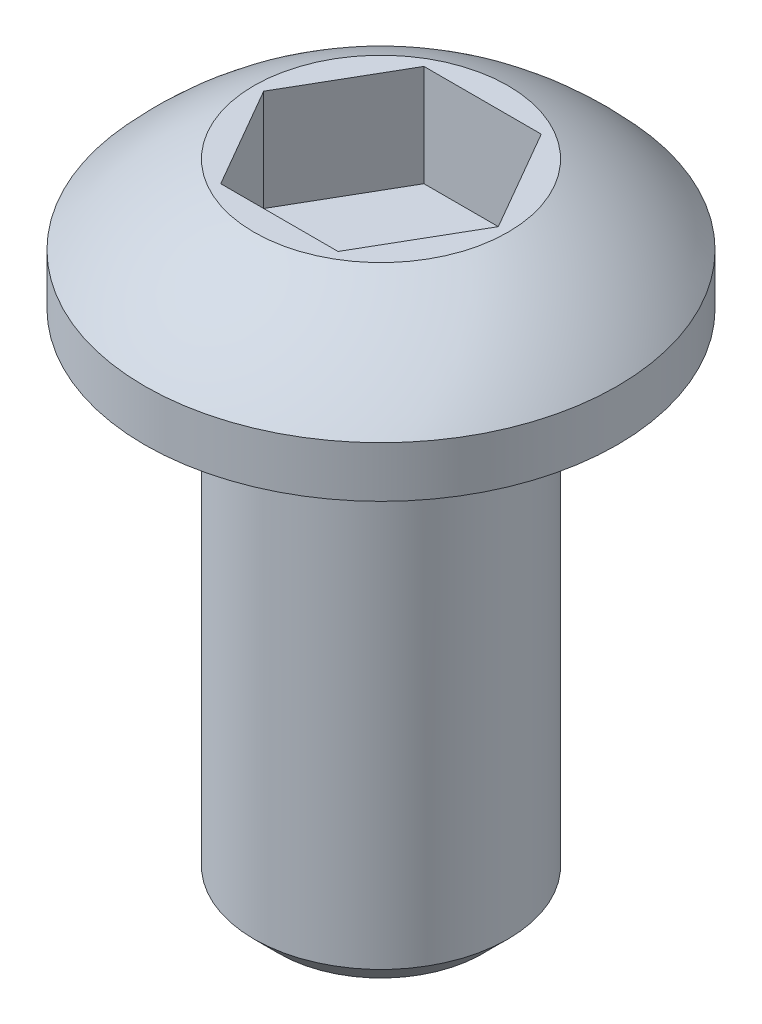
ISO-10303-21;
HEADER;
FILE_DESCRIPTION(('STEP AP214'),'2;1');
FILE_NAME('part.step','',(''),(''),'','','');
FILE_SCHEMA(('AUTOMOTIVE_DESIGN { 1 0 10303 214 1 1 1 1 }'));
ENDSEC;
DATA;
#1=APPLICATION_CONTEXT('core data for automotive mechanical design processes');
#2=APPLICATION_PROTOCOL_DEFINITION('international standard','automotive_design',2000,#1);
#3=PRODUCT_CONTEXT('',#1,'mechanical');
#4=PRODUCT('Part','Part','',(#3));
#5=PRODUCT_RELATED_PRODUCT_CATEGORY('part','',(#4));
#6=PRODUCT_DEFINITION_FORMATION('','',#4);
#7=PRODUCT_DEFINITION_CONTEXT('part definition',#1,'design');
#8=PRODUCT_DEFINITION('design','',#6,#7);
#9=PRODUCT_DEFINITION_SHAPE('','',#8);
#10=(LENGTH_UNIT() NAMED_UNIT(*) SI_UNIT(.MILLI.,.METRE.));
#11=(NAMED_UNIT(*) PLANE_ANGLE_UNIT() SI_UNIT($,.RADIAN.));
#12=(NAMED_UNIT(*) SI_UNIT($,.STERADIAN.) SOLID_ANGLE_UNIT());
#13=UNCERTAINTY_MEASURE_WITH_UNIT(LENGTH_MEASURE(1.E-05),#10,'distance_accuracy_value','');
#14=(GEOMETRIC_REPRESENTATION_CONTEXT(3) GLOBAL_UNCERTAINTY_ASSIGNED_CONTEXT((#13)) GLOBAL_UNIT_ASSIGNED_CONTEXT((#10,
#11,#12)) REPRESENTATION_CONTEXT('',''));
#15=CARTESIAN_POINT('',(0.,0.,0.));
#16=DIRECTION('',(0.,0.,1.));
#17=DIRECTION('',(1.,0.,0.));
#18=AXIS2_PLACEMENT_3D('',#15,#16,#17);
#19=CARTESIAN_POINT('',(2.3094010767585,10.55,0.));
#20=DIRECTION('',(0.,1.,0.));
#21=DIRECTION('',(0.,0.,1.));
#22=AXIS2_PLACEMENT_3D('',#19,#20,#21);
#23=PLANE('',#22);
#24=DIRECTION('',(-1.,0.,0.));
#25=VECTOR('',#24,1.);
#26=CARTESIAN_POINT('',(1.15470053837925,10.55,-2.));
#27=LINE('',#26,#25);
#28=CARTESIAN_POINT('',(1.15470053837925,10.55,-2.));
#29=VERTEX_POINT('',#28);
#30=CARTESIAN_POINT('',(-1.15470053837925,10.55,-2.));
#31=VERTEX_POINT('',#30);
#32=EDGE_CURVE('E72',#29,#31,#27,.T.);
#33=ORIENTED_EDGE('',*,*,#32,.T.);
#34=DIRECTION('',(-0.5,0.,0.866025403784439));
#35=VECTOR('',#34,1.);
#36=CARTESIAN_POINT('',(-1.15470053837925,10.55,-2.));
#37=LINE('',#36,#35);
#38=CARTESIAN_POINT('',(-2.3094010767585,10.55,0.));
#39=VERTEX_POINT('',#38);
#40=EDGE_CURVE('E127',#31,#39,#37,.T.);
#41=ORIENTED_EDGE('',*,*,#40,.T.);
#42=DIRECTION('',(0.5,0.,0.866025403784438));
#43=VECTOR('',#42,1.);
#44=CARTESIAN_POINT('',(-2.3094010767585,10.55,0.));
#45=LINE('',#44,#43);
#46=CARTESIAN_POINT('',(-1.15470053837925,10.55,2.));
#47=VERTEX_POINT('',#46);
#48=EDGE_CURVE('E132',#39,#47,#45,.T.);
#49=ORIENTED_EDGE('',*,*,#48,.T.);
#50=DIRECTION('',(1.,0.,0.));
#51=VECTOR('',#50,1.);
#52=CARTESIAN_POINT('',(-1.15470053837925,10.55,2.));
#53=LINE('',#52,#51);
#54=CARTESIAN_POINT('',(1.15470053837925,10.55,2.));
#55=VERTEX_POINT('',#54);
#56=EDGE_CURVE('E136',#47,#55,#53,.T.);
#57=ORIENTED_EDGE('',*,*,#56,.T.);
#58=DIRECTION('',(0.5,0.,-0.866025403784439));
#59=VECTOR('',#58,1.);
#60=CARTESIAN_POINT('',(1.15470053837925,10.55,2.));
#61=LINE('',#60,#59);
#62=CARTESIAN_POINT('',(2.3094010767585,10.55,0.));
#63=VERTEX_POINT('',#62);
#64=EDGE_CURVE('E68',#55,#63,#61,.T.);
#65=ORIENTED_EDGE('',*,*,#64,.T.);
#66=DIRECTION('',(-0.5,0.,-0.866025403784438));
#67=VECTOR('',#66,1.);
#68=CARTESIAN_POINT('',(2.3094010767585,10.55,0.));
#69=LINE('',#68,#67);
#70=EDGE_CURVE('E70',#63,#29,#69,.T.);
#71=ORIENTED_EDGE('',*,*,#70,.T.);
#72=EDGE_LOOP('',(#33,#41,#49,#57,#65,#71));
#73=FACE_BOUND('',#72,.T.);
#74=ADVANCED_FACE('F16',(#73),#23,.T.);
#75=CARTESIAN_POINT('',(1.15470053837925,10.55,-2.));
#76=DIRECTION('',(0.,0.,-1.));
#77=DIRECTION('',(-1.,0.,0.));
#78=AXIS2_PLACEMENT_3D('',#75,#76,#77);
#79=PLANE('',#78);
#80=ORIENTED_EDGE('',*,*,#32,.F.);
#81=DIRECTION('',(0.,1.,0.));
#82=VECTOR('',#81,1.);
#83=CARTESIAN_POINT('',(1.15470053837925,10.55,-2.));
#84=LINE('',#83,#82);
#85=CARTESIAN_POINT('',(1.15470053837925,12.55,-2.));
#86=VERTEX_POINT('',#85);
#87=EDGE_CURVE('E77',#29,#86,#84,.T.);
#88=ORIENTED_EDGE('',*,*,#87,.T.);
#89=DIRECTION('',(1.,0.,0.));
#90=VECTOR('',#89,1.);
#91=CARTESIAN_POINT('',(0.,12.55,-2.));
#92=LINE('',#91,#90);
#93=CARTESIAN_POINT('',(-1.15470053837925,12.55,-2.));
#94=VERTEX_POINT('',#93);
#95=EDGE_CURVE('E124',#94,#86,#92,.T.);
#96=ORIENTED_EDGE('',*,*,#95,.F.);
#97=DIRECTION('',(0.,1.,0.));
#98=VECTOR('',#97,1.);
#99=CARTESIAN_POINT('',(-1.15470053837925,10.55,-2.));
#100=LINE('',#99,#98);
#101=EDGE_CURVE('E83',#94,#31,#100,.F.);
#102=ORIENTED_EDGE('',*,*,#101,.T.);
#103=EDGE_LOOP('',(#80,#88,#96,#102));
#104=FACE_BOUND('',#103,.T.);
#105=ADVANCED_FACE('F80',(#104),#79,.F.);
#106=CARTESIAN_POINT('',(2.3094010767585,10.55,0.));
#107=DIRECTION('',(0.866025403784438,0.,-0.5));
#108=DIRECTION('',(-0.5,0.,-0.866025403784438));
#109=AXIS2_PLACEMENT_3D('',#106,#107,#108);
#110=PLANE('',#109);
#111=ORIENTED_EDGE('',*,*,#70,.F.);
#112=DIRECTION('',(0.,1.,0.));
#113=VECTOR('',#112,1.);
#114=CARTESIAN_POINT('',(2.3094010767585,10.55,0.));
#115=LINE('',#114,#113);
#116=CARTESIAN_POINT('',(2.3094010767585,12.55,0.));
#117=VERTEX_POINT('',#116);
#118=EDGE_CURVE('E91',#63,#117,#115,.T.);
#119=ORIENTED_EDGE('',*,*,#118,.T.);
#120=DIRECTION('',(0.5,0.,0.866025403784438));
#121=VECTOR('',#120,1.);
#122=CARTESIAN_POINT('',(1.15470053837925,12.55,-2.));
#123=LINE('',#122,#121);
#124=EDGE_CURVE('E88',#86,#117,#123,.T.);
#125=ORIENTED_EDGE('',*,*,#124,.F.);
#126=ORIENTED_EDGE('',*,*,#87,.F.);
#127=EDGE_LOOP('',(#111,#119,#125,#126));
#128=FACE_BOUND('',#127,.T.);
#129=ADVANCED_FACE('F86',(#128),#110,.F.);
#130=CARTESIAN_POINT('',(1.15470053837925,10.55,2.));
#131=DIRECTION('',(0.866025403784439,0.,0.5));
#132=DIRECTION('',(0.5,0.,-0.866025403784439));
#133=AXIS2_PLACEMENT_3D('',#130,#131,#132);
#134=PLANE('',#133);
#135=ORIENTED_EDGE('',*,*,#64,.F.);
#136=DIRECTION('',(0.,1.,0.));
#137=VECTOR('',#136,1.);
#138=CARTESIAN_POINT('',(1.15470053837925,10.55,2.));
#139=LINE('',#138,#137);
#140=CARTESIAN_POINT('',(1.15470053837925,12.55,2.));
#141=VERTEX_POINT('',#140);
#142=EDGE_CURVE('E134',#55,#141,#139,.T.);
#143=ORIENTED_EDGE('',*,*,#142,.T.);
#144=DIRECTION('',(-0.5,0.,0.866025403784438));
#145=VECTOR('',#144,1.);
#146=CARTESIAN_POINT('',(2.3094010767585,12.55,0.));
#147=LINE('',#146,#145);
#148=EDGE_CURVE('E120',#117,#141,#147,.T.);
#149=ORIENTED_EDGE('',*,*,#148,.F.);
#150=ORIENTED_EDGE('',*,*,#118,.F.);
#151=EDGE_LOOP('',(#135,#143,#149,#150));
#152=FACE_BOUND('',#151,.T.);
#153=ADVANCED_FACE('F139',(#152),#134,.F.);
#154=CARTESIAN_POINT('',(-1.15470053837925,10.55,2.));
#155=DIRECTION('',(0.,0.,1.));
#156=DIRECTION('',(1.,0.,0.));
#157=AXIS2_PLACEMENT_3D('',#154,#155,#156);
#158=PLANE('',#157);
#159=ORIENTED_EDGE('',*,*,#56,.F.);
#160=DIRECTION('',(0.,1.,0.));
#161=VECTOR('',#160,1.);
#162=CARTESIAN_POINT('',(-1.15470053837925,10.55,2.));
#163=LINE('',#162,#161);
#164=CARTESIAN_POINT('',(-1.15470053837925,12.55,2.));
#165=VERTEX_POINT('',#164);
#166=EDGE_CURVE('E130',#47,#165,#163,.T.);
#167=ORIENTED_EDGE('',*,*,#166,.T.);
#168=DIRECTION('',(1.,0.,0.));
#169=VECTOR('',#168,1.);
#170=CARTESIAN_POINT('',(0.,12.55,2.));
#171=LINE('',#170,#169);
#172=EDGE_CURVE('E115',#141,#165,#171,.F.);
#173=ORIENTED_EDGE('',*,*,#172,.F.);
#174=ORIENTED_EDGE('',*,*,#142,.F.);
#175=EDGE_LOOP('',(#159,#167,#173,#174));
#176=FACE_BOUND('',#175,.T.);
#177=ADVANCED_FACE('F150',(#176),#158,.F.);
#178=CARTESIAN_POINT('',(-2.3094010767585,10.55,0.));
#179=DIRECTION('',(-0.866025403784438,0.,0.5));
#180=DIRECTION('',(0.5,0.,0.866025403784438));
#181=AXIS2_PLACEMENT_3D('',#178,#179,#180);
#182=PLANE('',#181);
#183=ORIENTED_EDGE('',*,*,#48,.F.);
#184=DIRECTION('',(0.,1.,0.));
#185=VECTOR('',#184,1.);
#186=CARTESIAN_POINT('',(-2.3094010767585,10.55,0.));
#187=LINE('',#186,#185);
#188=CARTESIAN_POINT('',(-2.3094010767585,12.55,0.));
#189=VERTEX_POINT('',#188);
#190=EDGE_CURVE('E35',#39,#189,#187,.T.);
#191=ORIENTED_EDGE('',*,*,#190,.T.);
#192=DIRECTION('',(-0.5,0.,-0.866025403784438));
#193=VECTOR('',#192,1.);
#194=CARTESIAN_POINT('',(-1.15470053837925,12.55,2.));
#195=LINE('',#194,#193);
#196=EDGE_CURVE('E111',#165,#189,#195,.T.);
#197=ORIENTED_EDGE('',*,*,#196,.F.);
#198=ORIENTED_EDGE('',*,*,#166,.F.);
#199=EDGE_LOOP('',(#183,#191,#197,#198));
#200=FACE_BOUND('',#199,.T.);
#201=ADVANCED_FACE('F148',(#200),#182,.F.);
#202=CARTESIAN_POINT('',(-1.15470053837925,10.55,-2.));
#203=DIRECTION('',(-0.866025403784439,0.,-0.5));
#204=DIRECTION('',(-0.5,0.,0.866025403784439));
#205=AXIS2_PLACEMENT_3D('',#202,#203,#204);
#206=PLANE('',#205);
#207=ORIENTED_EDGE('',*,*,#40,.F.);
#208=ORIENTED_EDGE('',*,*,#101,.F.);
#209=DIRECTION('',(0.5,0.,-0.866025403784439));
#210=VECTOR('',#209,1.);
#211=CARTESIAN_POINT('',(-2.3094010767585,12.55,0.));
#212=LINE('',#211,#210);
#213=EDGE_CURVE('E107',#189,#94,#212,.T.);
#214=ORIENTED_EDGE('',*,*,#213,.F.);
#215=ORIENTED_EDGE('',*,*,#190,.F.);
#216=EDGE_LOOP('',(#207,#208,#214,#215));
#217=FACE_BOUND('',#216,.T.);
#218=ADVANCED_FACE('F145',(#217),#206,.F.);
#219=CARTESIAN_POINT('',(0.,12.55,0.));
#220=DIRECTION('',(0.,1.,0.));
#221=DIRECTION('',(0.,0.,1.));
#222=AXIS2_PLACEMENT_3D('',#219,#220,#221);
#223=PLANE('',#222);
#224=ORIENTED_EDGE('',*,*,#196,.T.);
#225=ORIENTED_EDGE('',*,*,#213,.T.);
#226=ORIENTED_EDGE('',*,*,#95,.T.);
#227=ORIENTED_EDGE('',*,*,#124,.T.);
#228=ORIENTED_EDGE('',*,*,#148,.T.);
#229=ORIENTED_EDGE('',*,*,#172,.T.);
#230=EDGE_LOOP('',(#224,#225,#226,#227,#228,#229));
#231=FACE_BOUND('',#230,.T.);
#232=CARTESIAN_POINT('',(0.,12.55,0.));
#233=DIRECTION('',(0.,1.,0.));
#234=DIRECTION('',(0.,0.,1.));
#235=AXIS2_PLACEMENT_3D('',#232,#233,#234);
#236=CIRCLE('',#235,2.5);
#237=CARTESIAN_POINT('',(0.,12.55,2.5));
#238=VERTEX_POINT('',#237);
#239=EDGE_CURVE('E20',#238,#238,#236,.F.);
#240=ORIENTED_EDGE('',*,*,#239,.F.);
#241=EDGE_LOOP('',(#240));
#242=FACE_BOUND('',#241,.T.);
#243=ADVANCED_FACE('F142',(#231,#242),#223,.T.);
#244=CARTESIAN_POINT('',(0.,6.81612903225806,0.));
#245=DIRECTION('',(0.,0.,-1.));
#246=DIRECTION('',(-0.747882256139405,0.663831402505059,0.));
#247=AXIS2_PLACEMENT_3D('',#244,#245,#246);
#248=SPHERICAL_SURFACE('',#247,6.25517995542205);
#249=CARTESIAN_POINT('',(0.,6.81612903225806,0.));
#250=DIRECTION('',(0.,-1.,0.));
#251=DIRECTION('',(0.,0.,-1.));
#252=AXIS2_PLACEMENT_3D('',#249,#250,#251);
#253=SPHERICAL_SURFACE('',#252,6.25517995542205);
#254=CARTESIAN_POINT('',(0.,11.,0.));
#255=DIRECTION('',(0.,-1.,0.));
#256=DIRECTION('',(0.,0.,-1.));
#257=AXIS2_PLACEMENT_3D('',#254,#255,#256);
#258=CIRCLE('',#257,4.65);
#259=CARTESIAN_POINT('',(0.,11.,-4.65));
#260=VERTEX_POINT('',#259);
#261=EDGE_CURVE('E102',#260,#260,#258,.T.);
#262=ORIENTED_EDGE('',*,*,#261,.F.);
#263=EDGE_LOOP('',(#262));
#264=FACE_BOUND('',#263,.T.);
#265=ORIENTED_EDGE('',*,*,#239,.T.);
#266=EDGE_LOOP('',(#265));
#267=FACE_BOUND('',#266,.T.);
#268=ADVANCED_FACE('F18',(#264,#267),#253,.T.);
#269=CARTESIAN_POINT('',(0.,0.,0.));
#270=DIRECTION('',(0.,-1.,0.));
#271=DIRECTION('',(0.,0.,-1.));
#272=AXIS2_PLACEMENT_3D('',#269,#270,#271);
#273=CYLINDRICAL_SURFACE('',#272,4.65);
#274=ORIENTED_EDGE('',*,*,#261,.T.);
#275=EDGE_LOOP('',(#274));
#276=FACE_BOUND('',#275,.T.);
#277=CARTESIAN_POINT('',(0.,10.,0.));
#278=DIRECTION('',(0.,-1.,0.));
#279=DIRECTION('',(0.,0.,-1.));
#280=AXIS2_PLACEMENT_3D('',#277,#278,#279);
#281=CIRCLE('',#280,4.65);
#282=CARTESIAN_POINT('',(0.,10.,-4.65));
#283=VERTEX_POINT('',#282);
#284=EDGE_CURVE('E100',#283,#283,#281,.T.);
#285=ORIENTED_EDGE('',*,*,#284,.F.);
#286=EDGE_LOOP('',(#285));
#287=FACE_BOUND('',#286,.T.);
#288=ADVANCED_FACE('F179',(#276,#287),#273,.T.);
#289=CARTESIAN_POINT('',(0.,0.,0.));
#290=DIRECTION('',(0.,-1.,0.));
#291=DIRECTION('',(0.,0.,-1.));
#292=AXIS2_PLACEMENT_3D('',#289,#290,#291);
#293=PLANE('',#292);
#294=CARTESIAN_POINT('',(0.,0.,0.));
#295=DIRECTION('',(0.,1.,0.));
#296=DIRECTION('',(0.,0.,1.));
#297=AXIS2_PLACEMENT_3D('',#294,#295,#296);
#298=CIRCLE('',#297,1.99999999995271);
#299=CARTESIAN_POINT('',(0.,0.,1.99999999995271));
#300=VERTEX_POINT('',#299);
#301=EDGE_CURVE('E97',#300,#300,#298,.T.);
#302=ORIENTED_EDGE('',*,*,#301,.F.);
#303=EDGE_LOOP('',(#302));
#304=FACE_BOUND('',#303,.T.);
#305=ADVANCED_FACE('F175',(#304),#293,.T.);
#306=CARTESIAN_POINT('',(0.,10.,-2.5));
#307=DIRECTION('',(0.,-1.,0.));
#308=DIRECTION('',(0.,0.,-1.));
#309=AXIS2_PLACEMENT_3D('',#306,#307,#308);
#310=PLANE('',#309);
#311=ORIENTED_EDGE('',*,*,#284,.T.);
#312=EDGE_LOOP('',(#311));
#313=FACE_BOUND('',#312,.T.);
#314=CARTESIAN_POINT('',(0.,10.,0.));
#315=DIRECTION('',(0.,-1.,0.));
#316=DIRECTION('',(0.,0.,-1.));
#317=AXIS2_PLACEMENT_3D('',#314,#315,#316);
#318=CIRCLE('',#317,2.5);
#319=CARTESIAN_POINT('',(0.,10.,-2.5));
#320=VERTEX_POINT('',#319);
#321=EDGE_CURVE('E26',#320,#320,#318,.T.);
#322=ORIENTED_EDGE('',*,*,#321,.F.);
#323=EDGE_LOOP('',(#322));
#324=FACE_BOUND('',#323,.T.);
#325=ADVANCED_FACE('F168',(#313,#324),#310,.T.);
#326=CARTESIAN_POINT('',(0.,0.499999999988177,0.));
#327=DIRECTION('',(0.,1.,0.));
#328=DIRECTION('',(0.,0.,1.));
#329=AXIS2_PLACEMENT_3D('',#326,#327,#328);
#330=CONICAL_SURFACE('',#329,2.49999999999773,0.785398163454292);
#331=CARTESIAN_POINT('',(0.,0.5,0.));
#332=DIRECTION('',(0.,-1.,0.));
#333=DIRECTION('',(0.,0.,-1.));
#334=AXIS2_PLACEMENT_3D('',#331,#332,#333);
#335=CIRCLE('',#334,2.5);
#336=CARTESIAN_POINT('',(0.,0.5,-2.5));
#337=VERTEX_POINT('',#336);
#338=EDGE_CURVE('E11',#337,#337,#335,.F.);
#339=ORIENTED_EDGE('',*,*,#338,.F.);
#340=EDGE_LOOP('',(#339));
#341=FACE_BOUND('',#340,.T.);
#342=ORIENTED_EDGE('',*,*,#301,.T.);
#343=EDGE_LOOP('',(#342));
#344=FACE_BOUND('',#343,.T.);
#345=ADVANCED_FACE('F162',(#341,#344),#330,.T.);
#346=CARTESIAN_POINT('',(0.,0.,0.));
#347=DIRECTION('',(0.,-1.,0.));
#348=DIRECTION('',(0.,0.,-1.));
#349=AXIS2_PLACEMENT_3D('',#346,#347,#348);
#350=CYLINDRICAL_SURFACE('',#349,2.5);
#351=ORIENTED_EDGE('',*,*,#338,.T.);
#352=EDGE_LOOP('',(#351));
#353=FACE_BOUND('',#352,.T.);
#354=ORIENTED_EDGE('',*,*,#321,.T.);
#355=EDGE_LOOP('',(#354));
#356=FACE_BOUND('',#355,.T.);
#357=ADVANCED_FACE('F160',(#353,#356),#350,.T.);
#358=CLOSED_SHELL('',(#74,#105,#129,#153,#177,#201,#218,#243,#268,#288,#305,#325,#345,#357));
#359=MANIFOLD_SOLID_BREP('B1',#358);
#360=ADVANCED_BREP_SHAPE_REPRESENTATION('',(#18,#359),#14);
#361=SHAPE_DEFINITION_REPRESENTATION(#9,#360);
ENDSEC;
END-ISO-10303-21;
